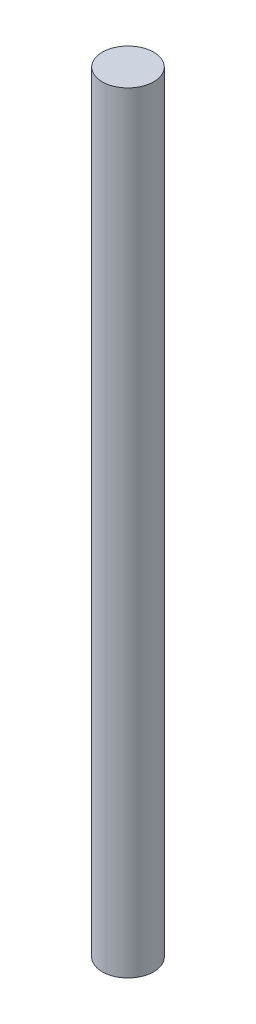
ISO-10303-21;
HEADER;
FILE_DESCRIPTION(('STEP AP214'),'2;1');
FILE_NAME('part.step','',(''),(''),'','','');
FILE_SCHEMA(('AUTOMOTIVE_DESIGN { 1 0 10303 214 1 1 1 1 }'));
ENDSEC;
DATA;
#1=APPLICATION_CONTEXT('core data for automotive mechanical design processes');
#2=APPLICATION_PROTOCOL_DEFINITION('international standard','automotive_design',2000,#1);
#3=PRODUCT_CONTEXT('',#1,'mechanical');
#4=PRODUCT('Part','Part','',(#3));
#5=PRODUCT_RELATED_PRODUCT_CATEGORY('part','',(#4));
#6=PRODUCT_DEFINITION_FORMATION('','',#4);
#7=PRODUCT_DEFINITION_CONTEXT('part definition',#1,'design');
#8=PRODUCT_DEFINITION('design','',#6,#7);
#9=PRODUCT_DEFINITION_SHAPE('','',#8);
#10=(LENGTH_UNIT() NAMED_UNIT(*) SI_UNIT(.MILLI.,.METRE.));
#11=(NAMED_UNIT(*) PLANE_ANGLE_UNIT() SI_UNIT($,.RADIAN.));
#12=(NAMED_UNIT(*) SI_UNIT($,.STERADIAN.) SOLID_ANGLE_UNIT());
#13=UNCERTAINTY_MEASURE_WITH_UNIT(LENGTH_MEASURE(1.E-05),#10,'distance_accuracy_value','');
#14=(GEOMETRIC_REPRESENTATION_CONTEXT(3) GLOBAL_UNCERTAINTY_ASSIGNED_CONTEXT((#13)) GLOBAL_UNIT_ASSIGNED_CONTEXT((#10,
#11,#12)) REPRESENTATION_CONTEXT('',''));
#15=CARTESIAN_POINT('',(0.,0.,0.));
#16=DIRECTION('',(0.,0.,1.));
#17=DIRECTION('',(1.,0.,0.));
#18=AXIS2_PLACEMENT_3D('',#15,#16,#17);
#19=CARTESIAN_POINT('',(0.,225.,0.));
#20=DIRECTION('',(0.,-1.,0.));
#21=DIRECTION('',(0.,0.,-1.));
#22=AXIS2_PLACEMENT_3D('',#19,#20,#21);
#23=CYLINDRICAL_SURFACE('',#22,7.5);
#24=CARTESIAN_POINT('',(0.,225.,0.));
#25=DIRECTION('',(0.,1.,0.));
#26=DIRECTION('',(0.,0.,1.));
#27=AXIS2_PLACEMENT_3D('',#24,#25,#26);
#28=CIRCLE('',#27,7.5);
#29=CARTESIAN_POINT('',(0.,225.,7.5));
#30=VERTEX_POINT('',#29);
#31=EDGE_CURVE('E10',#30,#30,#28,.T.);
#32=ORIENTED_EDGE('',*,*,#31,.F.);
#33=EDGE_LOOP('',(#32));
#34=FACE_BOUND('',#33,.T.);
#35=CARTESIAN_POINT('',(0.,0.,0.));
#36=DIRECTION('',(0.,1.,0.));
#37=DIRECTION('',(0.,0.,1.));
#38=AXIS2_PLACEMENT_3D('',#35,#36,#37);
#39=CIRCLE('',#38,7.5);
#40=CARTESIAN_POINT('',(0.,0.,7.5));
#41=VERTEX_POINT('',#40);
#42=EDGE_CURVE('E37',#41,#41,#39,.T.);
#43=ORIENTED_EDGE('',*,*,#42,.T.);
#44=EDGE_LOOP('',(#43));
#45=FACE_BOUND('',#44,.T.);
#46=ADVANCED_FACE('F34',(#34,#45),#23,.T.);
#47=CARTESIAN_POINT('',(0.,225.,0.));
#48=DIRECTION('',(0.,1.,0.));
#49=DIRECTION('',(0.,0.,1.));
#50=AXIS2_PLACEMENT_3D('',#47,#48,#49);
#51=PLANE('',#50);
#52=ORIENTED_EDGE('',*,*,#31,.T.);
#53=EDGE_LOOP('',(#52));
#54=FACE_BOUND('',#53,.T.);
#55=ADVANCED_FACE('F49',(#54),#51,.T.);
#56=CARTESIAN_POINT('',(0.,0.,0.));
#57=DIRECTION('',(0.,1.,0.));
#58=DIRECTION('',(0.,0.,1.));
#59=AXIS2_PLACEMENT_3D('',#56,#57,#58);
#60=PLANE('',#59);
#61=ORIENTED_EDGE('',*,*,#42,.F.);
#62=EDGE_LOOP('',(#61));
#63=FACE_BOUND('',#62,.T.);
#64=ADVANCED_FACE('F47',(#63),#60,.F.);
#65=CLOSED_SHELL('',(#46,#55,#64));
#66=MANIFOLD_SOLID_BREP('B2',#65);
#67=ADVANCED_BREP_SHAPE_REPRESENTATION('',(#18,#66),#14);
#68=SHAPE_DEFINITION_REPRESENTATION(#9,#67);
ENDSEC;
END-ISO-10303-21;
